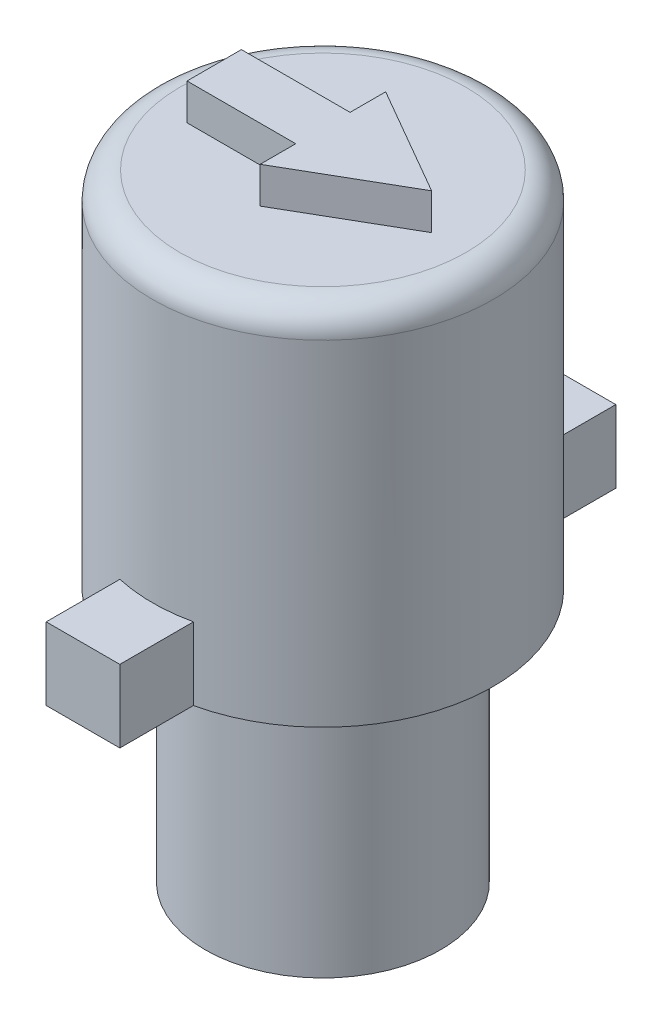
ISO-10303-21;
HEADER;
FILE_DESCRIPTION(('STEP AP214'),'2;1');
FILE_NAME('part.step','',(''),(''),'','','');
FILE_SCHEMA(('AUTOMOTIVE_DESIGN { 1 0 10303 214 1 1 1 1 }'));
ENDSEC;
DATA;
#1=APPLICATION_CONTEXT('core data for automotive mechanical design processes');
#2=APPLICATION_PROTOCOL_DEFINITION('international standard','automotive_design',2000,#1);
#3=PRODUCT_CONTEXT('',#1,'mechanical');
#4=PRODUCT('Part','Part','',(#3));
#5=PRODUCT_RELATED_PRODUCT_CATEGORY('part','',(#4));
#6=PRODUCT_DEFINITION_FORMATION('','',#4);
#7=PRODUCT_DEFINITION_CONTEXT('part definition',#1,'design');
#8=PRODUCT_DEFINITION('design','',#6,#7);
#9=PRODUCT_DEFINITION_SHAPE('','',#8);
#10=(LENGTH_UNIT() NAMED_UNIT(*) SI_UNIT(.MILLI.,.METRE.));
#11=(NAMED_UNIT(*) PLANE_ANGLE_UNIT() SI_UNIT($,.RADIAN.));
#12=(NAMED_UNIT(*) SI_UNIT($,.STERADIAN.) SOLID_ANGLE_UNIT());
#13=UNCERTAINTY_MEASURE_WITH_UNIT(LENGTH_MEASURE(1.E-05),#10,'distance_accuracy_value','');
#14=(GEOMETRIC_REPRESENTATION_CONTEXT(3) GLOBAL_UNCERTAINTY_ASSIGNED_CONTEXT((#13)) GLOBAL_UNIT_ASSIGNED_CONTEXT((#10,
#11,#12)) REPRESENTATION_CONTEXT('',''));
#15=CARTESIAN_POINT('',(0.,0.,0.));
#16=DIRECTION('',(0.,0.,1.));
#17=DIRECTION('',(1.,0.,0.));
#18=AXIS2_PLACEMENT_3D('',#15,#16,#17);
#19=CARTESIAN_POINT('',(0.,17.018,0.));
#20=DIRECTION('',(0.,1.,0.));
#21=DIRECTION('',(0.,0.,1.));
#22=AXIS2_PLACEMENT_3D('',#19,#20,#21);
#23=PLANE('',#22);
#24=CARTESIAN_POINT('',(0.,17.018,0.));
#25=DIRECTION('',(0.,1.,0.));
#26=DIRECTION('',(0.,0.,1.));
#27=AXIS2_PLACEMENT_3D('',#24,#25,#26);
#28=CIRCLE('',#27,3.95);
#29=CARTESIAN_POINT('',(0.,17.018,3.95));
#30=VERTEX_POINT('',#29);
#31=EDGE_CURVE('E72',#30,#30,#28,.T.);
#32=ORIENTED_EDGE('',*,*,#31,.T.);
#33=EDGE_LOOP('',(#32));
#34=FACE_BOUND('',#33,.T.);
#35=DIRECTION('',(-1.,0.,0.));
#36=VECTOR('',#35,1.);
#37=CARTESIAN_POINT('',(0.,17.018,-0.75));
#38=LINE('',#37,#36);
#39=CARTESIAN_POINT('',(0.,17.018,-0.75));
#40=VERTEX_POINT('',#39);
#41=CARTESIAN_POINT('',(-3.,17.018,-0.75));
#42=VERTEX_POINT('',#41);
#43=EDGE_CURVE('E285',#40,#42,#38,.T.);
#44=ORIENTED_EDGE('',*,*,#43,.F.);
#45=DIRECTION('',(0.,0.,1.));
#46=VECTOR('',#45,1.);
#47=CARTESIAN_POINT('',(0.,17.018,-1.73205080756888));
#48=LINE('',#47,#46);
#49=CARTESIAN_POINT('',(0.,17.018,-1.73205080756888));
#50=VERTEX_POINT('',#49);
#51=EDGE_CURVE('E213',#50,#40,#48,.T.);
#52=ORIENTED_EDGE('',*,*,#51,.F.);
#53=DIRECTION('',(-0.866025403784438,0.,-0.5));
#54=VECTOR('',#53,1.);
#55=CARTESIAN_POINT('',(3.,17.018,0.));
#56=LINE('',#55,#54);
#57=CARTESIAN_POINT('',(3.,17.018,0.));
#58=VERTEX_POINT('',#57);
#59=EDGE_CURVE('E263',#58,#50,#56,.T.);
#60=ORIENTED_EDGE('',*,*,#59,.F.);
#61=DIRECTION('',(0.866025403784439,0.,-0.5));
#62=VECTOR('',#61,1.);
#63=CARTESIAN_POINT('',(0.,17.018,1.73205080756888));
#64=LINE('',#63,#62);
#65=CARTESIAN_POINT('',(0.,17.018,1.73205080756888));
#66=VERTEX_POINT('',#65);
#67=EDGE_CURVE('E297',#66,#58,#64,.T.);
#68=ORIENTED_EDGE('',*,*,#67,.F.);
#69=DIRECTION('',(0.,0.,1.));
#70=VECTOR('',#69,1.);
#71=CARTESIAN_POINT('',(0.,17.018,0.75));
#72=LINE('',#71,#70);
#73=CARTESIAN_POINT('',(0.,17.018,0.75));
#74=VERTEX_POINT('',#73);
#75=EDGE_CURVE('E294',#74,#66,#72,.T.);
#76=ORIENTED_EDGE('',*,*,#75,.F.);
#77=DIRECTION('',(1.,0.,0.));
#78=VECTOR('',#77,1.);
#79=CARTESIAN_POINT('',(-3.,17.018,0.75));
#80=LINE('',#79,#78);
#81=CARTESIAN_POINT('',(-3.,17.018,0.75));
#82=VERTEX_POINT('',#81);
#83=EDGE_CURVE('E291',#82,#74,#80,.T.);
#84=ORIENTED_EDGE('',*,*,#83,.F.);
#85=DIRECTION('',(0.,0.,1.));
#86=VECTOR('',#85,1.);
#87=CARTESIAN_POINT('',(-3.,17.018,-0.75));
#88=LINE('',#87,#86);
#89=EDGE_CURVE('E288',#42,#82,#88,.T.);
#90=ORIENTED_EDGE('',*,*,#89,.F.);
#91=EDGE_LOOP('',(#44,#52,#60,#68,#76,#84,#90));
#92=FACE_BOUND('',#91,.T.);
#93=ADVANCED_FACE('F63',(#34,#92),#23,.T.);
#94=CARTESIAN_POINT('',(0.,7.018,0.));
#95=DIRECTION('',(0.,-1.,0.));
#96=DIRECTION('',(0.,0.,-1.));
#97=AXIS2_PLACEMENT_3D('',#94,#95,#96);
#98=CYLINDRICAL_SURFACE('',#97,3.25);
#99=CARTESIAN_POINT('',(0.,7.018,0.));
#100=DIRECTION('',(0.,1.,0.));
#101=DIRECTION('',(0.,0.,1.));
#102=AXIS2_PLACEMENT_3D('',#99,#100,#101);
#103=CIRCLE('',#102,3.25);
#104=CARTESIAN_POINT('',(0.,7.018,3.25));
#105=VERTEX_POINT('',#104);
#106=EDGE_CURVE('E333',#105,#105,#103,.T.);
#107=ORIENTED_EDGE('',*,*,#106,.F.);
#108=EDGE_LOOP('',(#107));
#109=FACE_BOUND('',#108,.T.);
#110=CARTESIAN_POINT('',(0.,0.,0.));
#111=DIRECTION('',(0.,1.,0.));
#112=DIRECTION('',(0.,0.,1.));
#113=AXIS2_PLACEMENT_3D('',#110,#111,#112);
#114=CIRCLE('',#113,3.25);
#115=CARTESIAN_POINT('',(0.,0.,3.25));
#116=VERTEX_POINT('',#115);
#117=EDGE_CURVE('E332',#116,#116,#114,.T.);
#118=ORIENTED_EDGE('',*,*,#117,.T.);
#119=EDGE_LOOP('',(#118));
#120=FACE_BOUND('',#119,.T.);
#121=ADVANCED_FACE('F362',(#109,#120),#98,.T.);
#122=CARTESIAN_POINT('',(0.,0.,0.));
#123=DIRECTION('',(0.,1.,0.));
#124=DIRECTION('',(0.,0.,1.));
#125=AXIS2_PLACEMENT_3D('',#122,#123,#124);
#126=PLANE('',#125);
#127=ORIENTED_EDGE('',*,*,#117,.F.);
#128=EDGE_LOOP('',(#127));
#129=FACE_BOUND('',#128,.T.);
#130=ADVANCED_FACE('F367',(#129),#126,.F.);
#131=CARTESIAN_POINT('',(0.,17.018,0.));
#132=DIRECTION('',(0.,-1.,0.));
#133=DIRECTION('',(0.,0.,-1.));
#134=AXIS2_PLACEMENT_3D('',#131,#132,#133);
#135=CYLINDRICAL_SURFACE('',#134,4.7);
#136=CARTESIAN_POINT('',(0.,7.018,0.));
#137=DIRECTION('',(0.,1.,0.));
#138=DIRECTION('',(0.,0.,1.));
#139=AXIS2_PLACEMENT_3D('',#136,#137,#138);
#140=CIRCLE('',#139,4.7);
#141=CARTESIAN_POINT('',(-1.651,7.018,-4.4004771332209));
#142=VERTEX_POINT('',#141);
#143=CARTESIAN_POINT('',(-1.016,7.018,4.58887175676113));
#144=VERTEX_POINT('',#143);
#145=EDGE_CURVE('E328',#142,#144,#140,.T.);
#146=ORIENTED_EDGE('',*,*,#145,.T.);
#147=DIRECTION('',(0.,-1.,0.));
#148=VECTOR('',#147,1.);
#149=CARTESIAN_POINT('',(-1.016,9.018,4.58887175676113));
#150=LINE('',#149,#148);
#151=CARTESIAN_POINT('',(-1.016,9.018,4.58887175676113));
#152=VERTEX_POINT('',#151);
#153=EDGE_CURVE('E79',#152,#144,#150,.T.);
#154=ORIENTED_EDGE('',*,*,#153,.F.);
#155=CARTESIAN_POINT('',(0.,9.018,0.));
#156=DIRECTION('',(0.,1.,0.));
#157=DIRECTION('',(0.,0.,-1.));
#158=AXIS2_PLACEMENT_3D('',#155,#156,#157);
#159=CIRCLE('',#158,4.7);
#160=CARTESIAN_POINT('',(1.016,9.018,4.58887175676113));
#161=VERTEX_POINT('',#160);
#162=EDGE_CURVE('E83',#152,#161,#159,.T.);
#163=ORIENTED_EDGE('',*,*,#162,.T.);
#164=DIRECTION('',(0.,-1.,0.));
#165=VECTOR('',#164,1.);
#166=CARTESIAN_POINT('',(1.016,9.018,4.58887175676113));
#167=LINE('',#166,#165);
#168=CARTESIAN_POINT('',(1.016,7.018,4.58887175676113));
#169=VERTEX_POINT('',#168);
#170=EDGE_CURVE('E183',#161,#169,#167,.T.);
#171=ORIENTED_EDGE('',*,*,#170,.T.);
#172=CARTESIAN_POINT('',(1.651,7.018,-4.4004771332209));
#173=VERTEX_POINT('',#172);
#174=EDGE_CURVE('E329',#169,#173,#140,.T.);
#175=ORIENTED_EDGE('',*,*,#174,.T.);
#176=DIRECTION('',(0.,-1.,0.));
#177=VECTOR('',#176,1.);
#178=CARTESIAN_POINT('',(1.651,9.018,-4.4004771332209));
#179=LINE('',#178,#177);
#180=CARTESIAN_POINT('',(1.651,9.018,-4.4004771332209));
#181=VERTEX_POINT('',#180);
#182=EDGE_CURVE('E229',#181,#173,#179,.T.);
#183=ORIENTED_EDGE('',*,*,#182,.F.);
#184=CARTESIAN_POINT('',(0.,9.018,0.));
#185=DIRECTION('',(0.,1.,0.));
#186=DIRECTION('',(0.,0.,-1.));
#187=AXIS2_PLACEMENT_3D('',#184,#185,#186);
#188=CIRCLE('',#187,4.7);
#189=CARTESIAN_POINT('',(-1.651,9.018,-4.4004771332209));
#190=VERTEX_POINT('',#189);
#191=EDGE_CURVE('E238',#181,#190,#188,.T.);
#192=ORIENTED_EDGE('',*,*,#191,.T.);
#193=DIRECTION('',(0.,-1.,0.));
#194=VECTOR('',#193,1.);
#195=CARTESIAN_POINT('',(-1.651,9.018,-4.4004771332209));
#196=LINE('',#195,#194);
#197=EDGE_CURVE('E218',#190,#142,#196,.T.);
#198=ORIENTED_EDGE('',*,*,#197,.T.);
#199=EDGE_LOOP('',(#146,#154,#163,#171,#175,#183,#192,#198));
#200=FACE_BOUND('',#199,.T.);
#201=CARTESIAN_POINT('',(0.,16.268,0.));
#202=DIRECTION('',(0.,1.,0.));
#203=DIRECTION('',(0.,0.,1.));
#204=AXIS2_PLACEMENT_3D('',#201,#202,#203);
#205=CIRCLE('',#204,4.7);
#206=CARTESIAN_POINT('',(0.,16.268,4.7));
#207=VERTEX_POINT('',#206);
#208=EDGE_CURVE('E12',#207,#207,#205,.F.);
#209=ORIENTED_EDGE('',*,*,#208,.T.);
#210=EDGE_LOOP('',(#209));
#211=FACE_BOUND('',#210,.T.);
#212=ADVANCED_FACE('F358',(#200,#211),#135,.T.);
#213=CARTESIAN_POINT('',(0.,7.018,0.));
#214=DIRECTION('',(0.,1.,0.));
#215=DIRECTION('',(0.,0.,1.));
#216=AXIS2_PLACEMENT_3D('',#213,#214,#215);
#217=PLANE('',#216);
#218=ORIENTED_EDGE('',*,*,#106,.T.);
#219=EDGE_LOOP('',(#218));
#220=FACE_BOUND('',#219,.T.);
#221=ORIENTED_EDGE('',*,*,#174,.F.);
#222=DIRECTION('',(0.,0.,1.));
#223=VECTOR('',#222,1.);
#224=CARTESIAN_POINT('',(1.016,7.018,6.62087175676113));
#225=LINE('',#224,#223);
#226=CARTESIAN_POINT('',(1.016,7.018,6.62087175676113));
#227=VERTEX_POINT('',#226);
#228=EDGE_CURVE('E202',#169,#227,#225,.T.);
#229=ORIENTED_EDGE('',*,*,#228,.T.);
#230=DIRECTION('',(-1.,0.,0.));
#231=VECTOR('',#230,1.);
#232=CARTESIAN_POINT('',(-1.016,7.018,6.62087175676113));
#233=LINE('',#232,#231);
#234=CARTESIAN_POINT('',(-1.016,7.018,6.62087175676113));
#235=VERTEX_POINT('',#234);
#236=EDGE_CURVE('E176',#227,#235,#233,.T.);
#237=ORIENTED_EDGE('',*,*,#236,.T.);
#238=DIRECTION('',(0.,0.,-1.));
#239=VECTOR('',#238,1.);
#240=CARTESIAN_POINT('',(-1.016,7.018,4.58887175676113));
#241=LINE('',#240,#239);
#242=EDGE_CURVE('E197',#235,#144,#241,.T.);
#243=ORIENTED_EDGE('',*,*,#242,.T.);
#244=ORIENTED_EDGE('',*,*,#145,.F.);
#245=DIRECTION('',(0.,0.,-1.));
#246=VECTOR('',#245,1.);
#247=CARTESIAN_POINT('',(-1.651,7.018,-4.4004771332209));
#248=LINE('',#247,#246);
#249=CARTESIAN_POINT('',(-1.651,7.018,-6.4324771332209));
#250=VERTEX_POINT('',#249);
#251=EDGE_CURVE('E205',#142,#250,#248,.T.);
#252=ORIENTED_EDGE('',*,*,#251,.T.);
#253=DIRECTION('',(1.,0.,0.));
#254=VECTOR('',#253,1.);
#255=CARTESIAN_POINT('',(-1.651,7.018,-6.4324771332209));
#256=LINE('',#255,#254);
#257=CARTESIAN_POINT('',(1.651,7.018,-6.4324771332209));
#258=VERTEX_POINT('',#257);
#259=EDGE_CURVE('E237',#250,#258,#256,.T.);
#260=ORIENTED_EDGE('',*,*,#259,.T.);
#261=DIRECTION('',(0.,0.,1.));
#262=VECTOR('',#261,1.);
#263=CARTESIAN_POINT('',(1.651,7.018,-6.4324771332209));
#264=LINE('',#263,#262);
#265=EDGE_CURVE('E233',#258,#173,#264,.T.);
#266=ORIENTED_EDGE('',*,*,#265,.T.);
#267=EDGE_LOOP('',(#221,#229,#237,#243,#244,#252,#260,#266));
#268=FACE_BOUND('',#267,.T.);
#269=ADVANCED_FACE('F347',(#220,#268),#217,.F.);
#270=CARTESIAN_POINT('',(0.,16.268,0.));
#271=DIRECTION('',(0.,1.,0.));
#272=DIRECTION('',(0.,0.,1.));
#273=AXIS2_PLACEMENT_3D('',#270,#271,#272);
#274=TOROIDAL_SURFACE('',#273,3.95,0.75);
#275=ORIENTED_EDGE('',*,*,#208,.F.);
#276=EDGE_LOOP('',(#275));
#277=FACE_BOUND('',#276,.T.);
#278=ORIENTED_EDGE('',*,*,#31,.F.);
#279=EDGE_LOOP('',(#278));
#280=FACE_BOUND('',#279,.T.);
#281=ADVANCED_FACE('F65',(#277,#280),#274,.T.);
#282=CARTESIAN_POINT('',(0.,18.018,-1.73205080756888));
#283=DIRECTION('',(1.,0.,0.));
#284=DIRECTION('',(0.,0.,-1.));
#285=AXIS2_PLACEMENT_3D('',#282,#283,#284);
#286=PLANE('',#285);
#287=ORIENTED_EDGE('',*,*,#51,.T.);
#288=DIRECTION('',(0.,-1.,0.));
#289=VECTOR('',#288,1.);
#290=CARTESIAN_POINT('',(0.,18.018,-0.75));
#291=LINE('',#290,#289);
#292=CARTESIAN_POINT('',(0.,18.018,-0.75));
#293=VERTEX_POINT('',#292);
#294=EDGE_CURVE('E325',#293,#40,#291,.T.);
#295=ORIENTED_EDGE('',*,*,#294,.F.);
#296=DIRECTION('',(0.,0.,1.));
#297=VECTOR('',#296,1.);
#298=CARTESIAN_POINT('',(0.,18.018,-1.73205080756888));
#299=LINE('',#298,#297);
#300=CARTESIAN_POINT('',(0.,18.018,-1.73205080756888));
#301=VERTEX_POINT('',#300);
#302=EDGE_CURVE('E258',#301,#293,#299,.T.);
#303=ORIENTED_EDGE('',*,*,#302,.F.);
#304=DIRECTION('',(0.,-1.,0.));
#305=VECTOR('',#304,1.);
#306=CARTESIAN_POINT('',(0.,18.018,-1.73205080756888));
#307=LINE('',#306,#305);
#308=EDGE_CURVE('E281',#301,#50,#307,.T.);
#309=ORIENTED_EDGE('',*,*,#308,.T.);
#310=EDGE_LOOP('',(#287,#295,#303,#309));
#311=FACE_BOUND('',#310,.T.);
#312=ADVANCED_FACE('F346',(#311),#286,.F.);
#313=CARTESIAN_POINT('',(0.,18.018,-0.75));
#314=DIRECTION('',(0.,0.,1.));
#315=DIRECTION('',(1.,0.,0.));
#316=AXIS2_PLACEMENT_3D('',#313,#314,#315);
#317=PLANE('',#316);
#318=ORIENTED_EDGE('',*,*,#43,.T.);
#319=DIRECTION('',(0.,-1.,0.));
#320=VECTOR('',#319,1.);
#321=CARTESIAN_POINT('',(-3.,18.018,-0.75));
#322=LINE('',#321,#320);
#323=CARTESIAN_POINT('',(-3.,18.018,-0.75));
#324=VERTEX_POINT('',#323);
#325=EDGE_CURVE('E321',#324,#42,#322,.T.);
#326=ORIENTED_EDGE('',*,*,#325,.F.);
#327=DIRECTION('',(-1.,0.,0.));
#328=VECTOR('',#327,1.);
#329=CARTESIAN_POINT('',(0.,18.018,-0.75));
#330=LINE('',#329,#328);
#331=EDGE_CURVE('E262',#293,#324,#330,.T.);
#332=ORIENTED_EDGE('',*,*,#331,.F.);
#333=ORIENTED_EDGE('',*,*,#294,.T.);
#334=EDGE_LOOP('',(#318,#326,#332,#333));
#335=FACE_BOUND('',#334,.T.);
#336=ADVANCED_FACE('F354',(#335),#317,.F.);
#337=CARTESIAN_POINT('',(-3.,18.018,-0.75));
#338=DIRECTION('',(1.,0.,0.));
#339=DIRECTION('',(0.,0.,-1.));
#340=AXIS2_PLACEMENT_3D('',#337,#338,#339);
#341=PLANE('',#340);
#342=ORIENTED_EDGE('',*,*,#89,.T.);
#343=DIRECTION('',(0.,-1.,0.));
#344=VECTOR('',#343,1.);
#345=CARTESIAN_POINT('',(-3.,18.018,0.75));
#346=LINE('',#345,#344);
#347=CARTESIAN_POINT('',(-3.,18.018,0.75));
#348=VERTEX_POINT('',#347);
#349=EDGE_CURVE('E317',#348,#82,#346,.T.);
#350=ORIENTED_EDGE('',*,*,#349,.F.);
#351=DIRECTION('',(0.,0.,1.));
#352=VECTOR('',#351,1.);
#353=CARTESIAN_POINT('',(-3.,18.018,-0.75));
#354=LINE('',#353,#352);
#355=EDGE_CURVE('E266',#324,#348,#354,.T.);
#356=ORIENTED_EDGE('',*,*,#355,.F.);
#357=ORIENTED_EDGE('',*,*,#325,.T.);
#358=EDGE_LOOP('',(#342,#350,#356,#357));
#359=FACE_BOUND('',#358,.T.);
#360=ADVANCED_FACE('F417',(#359),#341,.F.);
#361=CARTESIAN_POINT('',(-3.,18.018,0.75));
#362=DIRECTION('',(0.,0.,-1.));
#363=DIRECTION('',(-1.,0.,0.));
#364=AXIS2_PLACEMENT_3D('',#361,#362,#363);
#365=PLANE('',#364);
#366=ORIENTED_EDGE('',*,*,#83,.T.);
#367=DIRECTION('',(0.,-1.,0.));
#368=VECTOR('',#367,1.);
#369=CARTESIAN_POINT('',(0.,18.018,0.75));
#370=LINE('',#369,#368);
#371=CARTESIAN_POINT('',(0.,18.018,0.75));
#372=VERTEX_POINT('',#371);
#373=EDGE_CURVE('E313',#372,#74,#370,.T.);
#374=ORIENTED_EDGE('',*,*,#373,.F.);
#375=DIRECTION('',(1.,0.,0.));
#376=VECTOR('',#375,1.);
#377=CARTESIAN_POINT('',(-3.,18.018,0.75));
#378=LINE('',#377,#376);
#379=EDGE_CURVE('E269',#348,#372,#378,.T.);
#380=ORIENTED_EDGE('',*,*,#379,.F.);
#381=ORIENTED_EDGE('',*,*,#349,.T.);
#382=EDGE_LOOP('',(#366,#374,#380,#381));
#383=FACE_BOUND('',#382,.T.);
#384=ADVANCED_FACE('F425',(#383),#365,.F.);
#385=CARTESIAN_POINT('',(0.,18.018,0.75));
#386=DIRECTION('',(1.,0.,0.));
#387=DIRECTION('',(0.,0.,-1.));
#388=AXIS2_PLACEMENT_3D('',#385,#386,#387);
#389=PLANE('',#388);
#390=ORIENTED_EDGE('',*,*,#75,.T.);
#391=DIRECTION('',(0.,-1.,0.));
#392=VECTOR('',#391,1.);
#393=CARTESIAN_POINT('',(0.,18.018,1.73205080756888));
#394=LINE('',#393,#392);
#395=CARTESIAN_POINT('',(0.,18.018,1.73205080756888));
#396=VERTEX_POINT('',#395);
#397=EDGE_CURVE('E309',#396,#66,#394,.T.);
#398=ORIENTED_EDGE('',*,*,#397,.F.);
#399=DIRECTION('',(0.,0.,1.));
#400=VECTOR('',#399,1.);
#401=CARTESIAN_POINT('',(0.,18.018,0.75));
#402=LINE('',#401,#400);
#403=EDGE_CURVE('E272',#372,#396,#402,.T.);
#404=ORIENTED_EDGE('',*,*,#403,.F.);
#405=ORIENTED_EDGE('',*,*,#373,.T.);
#406=EDGE_LOOP('',(#390,#398,#404,#405));
#407=FACE_BOUND('',#406,.T.);
#408=ADVANCED_FACE('F434',(#407),#389,.F.);
#409=CARTESIAN_POINT('',(0.,18.018,1.73205080756888));
#410=DIRECTION('',(-0.5,0.,-0.866025403784439));
#411=DIRECTION('',(-0.866025403784439,0.,0.5));
#412=AXIS2_PLACEMENT_3D('',#409,#410,#411);
#413=PLANE('',#412);
#414=ORIENTED_EDGE('',*,*,#67,.T.);
#415=DIRECTION('',(0.,-1.,0.));
#416=VECTOR('',#415,1.);
#417=CARTESIAN_POINT('',(3.,18.018,0.));
#418=LINE('',#417,#416);
#419=CARTESIAN_POINT('',(3.,18.018,0.));
#420=VERTEX_POINT('',#419);
#421=EDGE_CURVE('E306',#420,#58,#418,.T.);
#422=ORIENTED_EDGE('',*,*,#421,.F.);
#423=DIRECTION('',(0.866025403784439,0.,-0.5));
#424=VECTOR('',#423,1.);
#425=CARTESIAN_POINT('',(0.,18.018,1.73205080756888));
#426=LINE('',#425,#424);
#427=EDGE_CURVE('E275',#396,#420,#426,.T.);
#428=ORIENTED_EDGE('',*,*,#427,.F.);
#429=ORIENTED_EDGE('',*,*,#397,.T.);
#430=EDGE_LOOP('',(#414,#422,#428,#429));
#431=FACE_BOUND('',#430,.T.);
#432=ADVANCED_FACE('F443',(#431),#413,.F.);
#433=CARTESIAN_POINT('',(3.,18.018,0.));
#434=DIRECTION('',(-0.5,0.,0.866025403784438));
#435=DIRECTION('',(0.866025403784438,0.,0.5));
#436=AXIS2_PLACEMENT_3D('',#433,#434,#435);
#437=PLANE('',#436);
#438=ORIENTED_EDGE('',*,*,#59,.T.);
#439=ORIENTED_EDGE('',*,*,#308,.F.);
#440=DIRECTION('',(-0.866025403784438,0.,-0.5));
#441=VECTOR('',#440,1.);
#442=CARTESIAN_POINT('',(3.,18.018,0.));
#443=LINE('',#442,#441);
#444=EDGE_CURVE('E278',#420,#301,#443,.T.);
#445=ORIENTED_EDGE('',*,*,#444,.F.);
#446=ORIENTED_EDGE('',*,*,#421,.T.);
#447=EDGE_LOOP('',(#438,#439,#445,#446));
#448=FACE_BOUND('',#447,.T.);
#449=ADVANCED_FACE('F452',(#448),#437,.F.);
#450=CARTESIAN_POINT('',(0.,18.018,0.));
#451=DIRECTION('',(0.,-1.,0.));
#452=DIRECTION('',(0.,0.,-1.));
#453=AXIS2_PLACEMENT_3D('',#450,#451,#452);
#454=PLANE('',#453);
#455=ORIENTED_EDGE('',*,*,#302,.T.);
#456=ORIENTED_EDGE('',*,*,#331,.T.);
#457=ORIENTED_EDGE('',*,*,#355,.T.);
#458=ORIENTED_EDGE('',*,*,#379,.T.);
#459=ORIENTED_EDGE('',*,*,#403,.T.);
#460=ORIENTED_EDGE('',*,*,#427,.T.);
#461=ORIENTED_EDGE('',*,*,#444,.T.);
#462=EDGE_LOOP('',(#455,#456,#457,#458,#459,#460,#461));
#463=FACE_BOUND('',#462,.T.);
#464=ADVANCED_FACE('F461',(#463),#454,.F.);
#465=CARTESIAN_POINT('',(1.651,9.018,-6.4324771332209));
#466=DIRECTION('',(1.,0.,0.));
#467=DIRECTION('',(0.,0.,-1.));
#468=AXIS2_PLACEMENT_3D('',#465,#466,#467);
#469=PLANE('',#468);
#470=ORIENTED_EDGE('',*,*,#265,.F.);
#471=DIRECTION('',(0.,-1.,0.));
#472=VECTOR('',#471,1.);
#473=CARTESIAN_POINT('',(1.651,9.018,-6.4324771332209));
#474=LINE('',#473,#472);
#475=CARTESIAN_POINT('',(1.651,9.018,-6.4324771332209));
#476=VERTEX_POINT('',#475);
#477=EDGE_CURVE('E226',#476,#258,#474,.T.);
#478=ORIENTED_EDGE('',*,*,#477,.F.);
#479=DIRECTION('',(0.,0.,1.));
#480=VECTOR('',#479,1.);
#481=CARTESIAN_POINT('',(1.651,9.018,-6.4324771332209));
#482=LINE('',#481,#480);
#483=EDGE_CURVE('E222',#476,#181,#482,.T.);
#484=ORIENTED_EDGE('',*,*,#483,.T.);
#485=ORIENTED_EDGE('',*,*,#182,.T.);
#486=EDGE_LOOP('',(#470,#478,#484,#485));
#487=FACE_BOUND('',#486,.T.);
#488=ADVANCED_FACE('F470',(#487),#469,.T.);
#489=CARTESIAN_POINT('',(-1.651,9.018,-6.4324771332209));
#490=DIRECTION('',(0.,0.,-1.));
#491=DIRECTION('',(-1.,0.,0.));
#492=AXIS2_PLACEMENT_3D('',#489,#490,#491);
#493=PLANE('',#492);
#494=ORIENTED_EDGE('',*,*,#259,.F.);
#495=DIRECTION('',(0.,-1.,0.));
#496=VECTOR('',#495,1.);
#497=CARTESIAN_POINT('',(-1.651,9.018,-6.4324771332209));
#498=LINE('',#497,#496);
#499=CARTESIAN_POINT('',(-1.651,9.018,-6.4324771332209));
#500=VERTEX_POINT('',#499);
#501=EDGE_CURVE('E223',#500,#250,#498,.T.);
#502=ORIENTED_EDGE('',*,*,#501,.F.);
#503=DIRECTION('',(1.,0.,0.));
#504=VECTOR('',#503,1.);
#505=CARTESIAN_POINT('',(-1.651,9.018,-6.4324771332209));
#506=LINE('',#505,#504);
#507=EDGE_CURVE('E248',#500,#476,#506,.T.);
#508=ORIENTED_EDGE('',*,*,#507,.T.);
#509=ORIENTED_EDGE('',*,*,#477,.T.);
#510=EDGE_LOOP('',(#494,#502,#508,#509));
#511=FACE_BOUND('',#510,.T.);
#512=ADVANCED_FACE('F479',(#511),#493,.T.);
#513=CARTESIAN_POINT('',(-1.651,9.018,-4.4004771332209));
#514=DIRECTION('',(-1.,0.,0.));
#515=DIRECTION('',(0.,0.,1.));
#516=AXIS2_PLACEMENT_3D('',#513,#514,#515);
#517=PLANE('',#516);
#518=ORIENTED_EDGE('',*,*,#251,.F.);
#519=ORIENTED_EDGE('',*,*,#197,.F.);
#520=DIRECTION('',(0.,0.,-1.));
#521=VECTOR('',#520,1.);
#522=CARTESIAN_POINT('',(-1.651,9.018,-4.4004771332209));
#523=LINE('',#522,#521);
#524=EDGE_CURVE('E252',#190,#500,#523,.T.);
#525=ORIENTED_EDGE('',*,*,#524,.T.);
#526=ORIENTED_EDGE('',*,*,#501,.T.);
#527=EDGE_LOOP('',(#518,#519,#525,#526));
#528=FACE_BOUND('',#527,.T.);
#529=ADVANCED_FACE('F489',(#528),#517,.T.);
#530=CARTESIAN_POINT('',(0.,9.018,0.));
#531=DIRECTION('',(0.,-1.,0.));
#532=DIRECTION('',(0.,0.,-1.));
#533=AXIS2_PLACEMENT_3D('',#530,#531,#532);
#534=PLANE('',#533);
#535=ORIENTED_EDGE('',*,*,#191,.F.);
#536=ORIENTED_EDGE('',*,*,#483,.F.);
#537=ORIENTED_EDGE('',*,*,#507,.F.);
#538=ORIENTED_EDGE('',*,*,#524,.F.);
#539=EDGE_LOOP('',(#535,#536,#537,#538));
#540=FACE_BOUND('',#539,.T.);
#541=ADVANCED_FACE('F498',(#540),#534,.F.);
#542=CARTESIAN_POINT('',(-1.016,9.018,4.58887175676113));
#543=DIRECTION('',(-1.,0.,0.));
#544=DIRECTION('',(0.,0.,1.));
#545=AXIS2_PLACEMENT_3D('',#542,#543,#544);
#546=PLANE('',#545);
#547=ORIENTED_EDGE('',*,*,#242,.F.);
#548=DIRECTION('',(0.,-1.,0.));
#549=VECTOR('',#548,1.);
#550=CARTESIAN_POINT('',(-1.016,9.018,6.62087175676113));
#551=LINE('',#550,#549);
#552=CARTESIAN_POINT('',(-1.016,9.018,6.62087175676113));
#553=VERTEX_POINT('',#552);
#554=EDGE_CURVE('E182',#553,#235,#551,.T.);
#555=ORIENTED_EDGE('',*,*,#554,.F.);
#556=DIRECTION('',(0.,0.,-1.));
#557=VECTOR('',#556,1.);
#558=CARTESIAN_POINT('',(-1.016,9.018,4.58887175676113));
#559=LINE('',#558,#557);
#560=EDGE_CURVE('E190',#553,#152,#559,.T.);
#561=ORIENTED_EDGE('',*,*,#560,.T.);
#562=ORIENTED_EDGE('',*,*,#153,.T.);
#563=EDGE_LOOP('',(#547,#555,#561,#562));
#564=FACE_BOUND('',#563,.T.);
#565=ADVANCED_FACE('F507',(#564),#546,.T.);
#566=CARTESIAN_POINT('',(-1.016,9.018,6.62087175676113));
#567=DIRECTION('',(0.,0.,1.));
#568=DIRECTION('',(1.,0.,0.));
#569=AXIS2_PLACEMENT_3D('',#566,#567,#568);
#570=PLANE('',#569);
#571=ORIENTED_EDGE('',*,*,#236,.F.);
#572=DIRECTION('',(0.,-1.,0.));
#573=VECTOR('',#572,1.);
#574=CARTESIAN_POINT('',(1.016,9.018,6.62087175676113));
#575=LINE('',#574,#573);
#576=CARTESIAN_POINT('',(1.016,9.018,6.62087175676113));
#577=VERTEX_POINT('',#576);
#578=EDGE_CURVE('E170',#577,#227,#575,.T.);
#579=ORIENTED_EDGE('',*,*,#578,.F.);
#580=DIRECTION('',(-1.,0.,0.));
#581=VECTOR('',#580,1.);
#582=CARTESIAN_POINT('',(-1.016,9.018,6.62087175676113));
#583=LINE('',#582,#581);
#584=EDGE_CURVE('E173',#577,#553,#583,.T.);
#585=ORIENTED_EDGE('',*,*,#584,.T.);
#586=ORIENTED_EDGE('',*,*,#554,.T.);
#587=EDGE_LOOP('',(#571,#579,#585,#586));
#588=FACE_BOUND('',#587,.T.);
#589=ADVANCED_FACE('F172',(#588),#570,.T.);
#590=CARTESIAN_POINT('',(1.016,9.018,6.62087175676113));
#591=DIRECTION('',(1.,0.,0.));
#592=DIRECTION('',(0.,0.,-1.));
#593=AXIS2_PLACEMENT_3D('',#590,#591,#592);
#594=PLANE('',#593);
#595=ORIENTED_EDGE('',*,*,#228,.F.);
#596=ORIENTED_EDGE('',*,*,#170,.F.);
#597=DIRECTION('',(0.,0.,1.));
#598=VECTOR('',#597,1.);
#599=CARTESIAN_POINT('',(1.016,9.018,6.62087175676113));
#600=LINE('',#599,#598);
#601=EDGE_CURVE('E188',#161,#577,#600,.T.);
#602=ORIENTED_EDGE('',*,*,#601,.T.);
#603=ORIENTED_EDGE('',*,*,#578,.T.);
#604=EDGE_LOOP('',(#595,#596,#602,#603));
#605=FACE_BOUND('',#604,.T.);
#606=ADVANCED_FACE('F193',(#605),#594,.T.);
#607=CARTESIAN_POINT('',(0.,9.018,0.));
#608=DIRECTION('',(0.,-1.,0.));
#609=DIRECTION('',(0.,0.,-1.));
#610=AXIS2_PLACEMENT_3D('',#607,#608,#609);
#611=PLANE('',#610);
#612=ORIENTED_EDGE('',*,*,#162,.F.);
#613=ORIENTED_EDGE('',*,*,#560,.F.);
#614=ORIENTED_EDGE('',*,*,#584,.F.);
#615=ORIENTED_EDGE('',*,*,#601,.F.);
#616=EDGE_LOOP('',(#612,#613,#614,#615));
#617=FACE_BOUND('',#616,.T.);
#618=ADVANCED_FACE('F187',(#617),#611,.F.);
#619=CLOSED_SHELL('',(#93,#121,#130,#212,#269,#281,#312,#336,#360,#384,#408,#432,#449,#464,#488,
#512,#529,#541,#565,#589,#606,#618));
#620=MANIFOLD_SOLID_BREP('B2',#619);
#621=ADVANCED_BREP_SHAPE_REPRESENTATION('',(#18,#620),#14);
#622=SHAPE_DEFINITION_REPRESENTATION(#9,#621);
ENDSEC;
END-ISO-10303-21;
